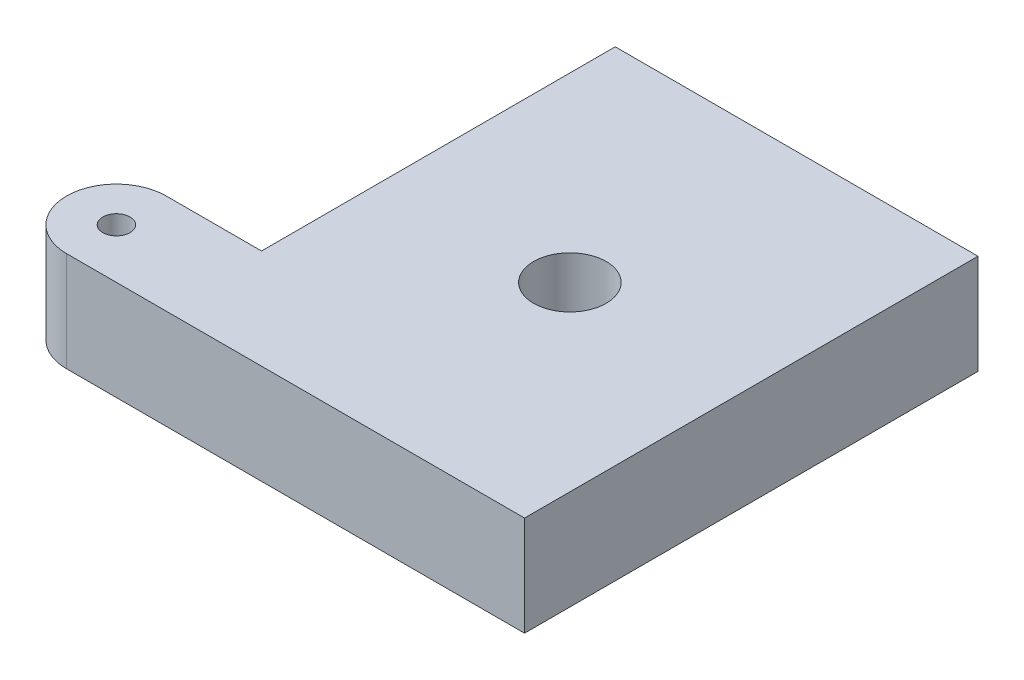
ISO-10303-21;
HEADER;
FILE_DESCRIPTION(('STEP AP214'),'2;1');
FILE_NAME('part.step','',(''),(''),'','','');
FILE_SCHEMA(('AUTOMOTIVE_DESIGN { 1 0 10303 214 1 1 1 1 }'));
ENDSEC;
DATA;
#1=APPLICATION_CONTEXT('core data for automotive mechanical design processes');
#2=APPLICATION_PROTOCOL_DEFINITION('international standard','automotive_design',2000,#1);
#3=PRODUCT_CONTEXT('',#1,'mechanical');
#4=PRODUCT('Part','Part','',(#3));
#5=PRODUCT_RELATED_PRODUCT_CATEGORY('part','',(#4));
#6=PRODUCT_DEFINITION_FORMATION('','',#4);
#7=PRODUCT_DEFINITION_CONTEXT('part definition',#1,'design');
#8=PRODUCT_DEFINITION('design','',#6,#7);
#9=PRODUCT_DEFINITION_SHAPE('','',#8);
#10=(LENGTH_UNIT() NAMED_UNIT(*) SI_UNIT(.MILLI.,.METRE.));
#11=(NAMED_UNIT(*) PLANE_ANGLE_UNIT() SI_UNIT($,.RADIAN.));
#12=(NAMED_UNIT(*) SI_UNIT($,.STERADIAN.) SOLID_ANGLE_UNIT());
#13=UNCERTAINTY_MEASURE_WITH_UNIT(LENGTH_MEASURE(1.E-05),#10,'distance_accuracy_value','');
#14=(GEOMETRIC_REPRESENTATION_CONTEXT(3) GLOBAL_UNCERTAINTY_ASSIGNED_CONTEXT((#13)) GLOBAL_UNIT_ASSIGNED_CONTEXT((#10,
#11,#12)) REPRESENTATION_CONTEXT('',''));
#15=CARTESIAN_POINT('',(0.,0.,0.));
#16=DIRECTION('',(0.,0.,1.));
#17=DIRECTION('',(1.,0.,0.));
#18=AXIS2_PLACEMENT_3D('',#15,#16,#17);
#19=CARTESIAN_POINT('',(0.,22.,0.));
#20=DIRECTION('',(0.,1.,0.));
#21=DIRECTION('',(0.,0.,1.));
#22=AXIS2_PLACEMENT_3D('',#19,#20,#21);
#23=PLANE('',#22);
#24=CARTESIAN_POINT('',(0.,22.,0.));
#25=DIRECTION('',(0.,1.,0.));
#26=DIRECTION('',(0.,0.,1.));
#27=AXIS2_PLACEMENT_3D('',#24,#25,#26);
#28=CIRCLE('',#27,8.);
#29=CARTESIAN_POINT('',(0.,22.,8.));
#30=VERTEX_POINT('',#29);
#31=EDGE_CURVE('E143',#30,#30,#28,.F.);
#32=ORIENTED_EDGE('',*,*,#31,.T.);
#33=EDGE_LOOP('',(#32));
#34=FACE_BOUND('',#33,.T.);
#35=CARTESIAN_POINT('',(-61.,22.,39.));
#36=DIRECTION('',(0.,-1.,0.));
#37=DIRECTION('',(0.,0.,-1.));
#38=AXIS2_PLACEMENT_3D('',#35,#36,#37);
#39=CIRCLE('',#38,3.);
#40=CARTESIAN_POINT('',(-61.,22.,36.));
#41=VERTEX_POINT('',#40);
#42=EDGE_CURVE('E145',#41,#41,#39,.T.);
#43=ORIENTED_EDGE('',*,*,#42,.T.);
#44=EDGE_LOOP('',(#43));
#45=FACE_BOUND('',#44,.T.);
#46=DIRECTION('',(-1.,0.,0.));
#47=VECTOR('',#46,1.);
#48=CARTESIAN_POINT('',(-40.,22.,28.));
#49=LINE('',#48,#47);
#50=CARTESIAN_POINT('',(-61.,22.,28.));
#51=VERTEX_POINT('',#50);
#52=CARTESIAN_POINT('',(-40.,22.,28.));
#53=VERTEX_POINT('',#52);
#54=EDGE_CURVE('E82',#51,#53,#49,.F.);
#55=ORIENTED_EDGE('',*,*,#54,.F.);
#56=CARTESIAN_POINT('',(-61.,22.,39.));
#57=DIRECTION('',(0.,1.,0.));
#58=DIRECTION('',(0.,0.,1.));
#59=AXIS2_PLACEMENT_3D('',#56,#57,#58);
#60=CIRCLE('',#59,11.);
#61=CARTESIAN_POINT('',(-61.,22.,50.));
#62=VERTEX_POINT('',#61);
#63=EDGE_CURVE('E20',#62,#51,#60,.F.);
#64=ORIENTED_EDGE('',*,*,#63,.F.);
#65=DIRECTION('',(1.,0.,0.));
#66=VECTOR('',#65,1.);
#67=CARTESIAN_POINT('',(-40.,22.,50.));
#68=LINE('',#67,#66);
#69=CARTESIAN_POINT('',(40.,22.,50.));
#70=VERTEX_POINT('',#69);
#71=EDGE_CURVE('E46',#70,#62,#68,.F.);
#72=ORIENTED_EDGE('',*,*,#71,.F.);
#73=DIRECTION('',(0.,0.,-1.));
#74=VECTOR('',#73,1.);
#75=CARTESIAN_POINT('',(40.,22.,50.));
#76=LINE('',#75,#74);
#77=CARTESIAN_POINT('',(40.,22.,-50.));
#78=VERTEX_POINT('',#77);
#79=EDGE_CURVE('E57',#78,#70,#76,.F.);
#80=ORIENTED_EDGE('',*,*,#79,.F.);
#81=DIRECTION('',(-1.,0.,0.));
#82=VECTOR('',#81,1.);
#83=CARTESIAN_POINT('',(40.,22.,-50.));
#84=LINE('',#83,#82);
#85=CARTESIAN_POINT('',(-40.,22.,-50.));
#86=VERTEX_POINT('',#85);
#87=EDGE_CURVE('E69',#86,#78,#84,.F.);
#88=ORIENTED_EDGE('',*,*,#87,.F.);
#89=DIRECTION('',(0.,0.,1.));
#90=VECTOR('',#89,1.);
#91=CARTESIAN_POINT('',(-40.,22.,-50.));
#92=LINE('',#91,#90);
#93=EDGE_CURVE('E75',#53,#86,#92,.F.);
#94=ORIENTED_EDGE('',*,*,#93,.F.);
#95=EDGE_LOOP('',(#55,#64,#72,#80,#88,#94));
#96=FACE_BOUND('',#95,.T.);
#97=ADVANCED_FACE('F17',(#34,#45,#96),#23,.T.);
#98=CARTESIAN_POINT('',(40.,0.,50.));
#99=DIRECTION('',(1.,0.,0.));
#100=DIRECTION('',(0.,0.,-1.));
#101=AXIS2_PLACEMENT_3D('',#98,#99,#100);
#102=PLANE('',#101);
#103=ORIENTED_EDGE('',*,*,#79,.T.);
#104=DIRECTION('',(0.,1.,0.));
#105=VECTOR('',#104,1.);
#106=CARTESIAN_POINT('',(40.,0.,50.));
#107=LINE('',#106,#105);
#108=CARTESIAN_POINT('',(40.,0.,50.));
#109=VERTEX_POINT('',#108);
#110=EDGE_CURVE('E124',#109,#70,#107,.T.);
#111=ORIENTED_EDGE('',*,*,#110,.F.);
#112=DIRECTION('',(0.,0.,1.));
#113=VECTOR('',#112,1.);
#114=CARTESIAN_POINT('',(40.,0.,0.));
#115=LINE('',#114,#113);
#116=CARTESIAN_POINT('',(40.,0.,-50.));
#117=VERTEX_POINT('',#116);
#118=EDGE_CURVE('E108',#109,#117,#115,.F.);
#119=ORIENTED_EDGE('',*,*,#118,.T.);
#120=DIRECTION('',(0.,1.,0.));
#121=VECTOR('',#120,1.);
#122=CARTESIAN_POINT('',(40.,0.,-50.));
#123=LINE('',#122,#121);
#124=EDGE_CURVE('E87',#78,#117,#123,.F.);
#125=ORIENTED_EDGE('',*,*,#124,.F.);
#126=EDGE_LOOP('',(#103,#111,#119,#125));
#127=FACE_BOUND('',#126,.T.);
#128=ADVANCED_FACE('F165',(#127),#102,.T.);
#129=CARTESIAN_POINT('',(40.,0.,-50.));
#130=DIRECTION('',(0.,0.,-1.));
#131=DIRECTION('',(-1.,0.,0.));
#132=AXIS2_PLACEMENT_3D('',#129,#130,#131);
#133=PLANE('',#132);
#134=ORIENTED_EDGE('',*,*,#87,.T.);
#135=ORIENTED_EDGE('',*,*,#124,.T.);
#136=DIRECTION('',(1.,0.,0.));
#137=VECTOR('',#136,1.);
#138=CARTESIAN_POINT('',(0.,0.,-50.));
#139=LINE('',#138,#137);
#140=CARTESIAN_POINT('',(-40.,0.,-50.));
#141=VERTEX_POINT('',#140);
#142=EDGE_CURVE('E106',#117,#141,#139,.F.);
#143=ORIENTED_EDGE('',*,*,#142,.T.);
#144=DIRECTION('',(0.,1.,0.));
#145=VECTOR('',#144,1.);
#146=CARTESIAN_POINT('',(-40.,0.,-50.));
#147=LINE('',#146,#145);
#148=EDGE_CURVE('E90',#86,#141,#147,.F.);
#149=ORIENTED_EDGE('',*,*,#148,.F.);
#150=EDGE_LOOP('',(#134,#135,#143,#149));
#151=FACE_BOUND('',#150,.T.);
#152=ADVANCED_FACE('F164',(#151),#133,.T.);
#153=CARTESIAN_POINT('',(-40.,0.,-50.));
#154=DIRECTION('',(-1.,0.,0.));
#155=DIRECTION('',(0.,0.,1.));
#156=AXIS2_PLACEMENT_3D('',#153,#154,#155);
#157=PLANE('',#156);
#158=ORIENTED_EDGE('',*,*,#148,.T.);
#159=DIRECTION('',(0.,0.,1.));
#160=VECTOR('',#159,1.);
#161=CARTESIAN_POINT('',(-40.,0.,0.));
#162=LINE('',#161,#160);
#163=CARTESIAN_POINT('',(-40.,0.,28.));
#164=VERTEX_POINT('',#163);
#165=EDGE_CURVE('E101',#141,#164,#162,.T.);
#166=ORIENTED_EDGE('',*,*,#165,.T.);
#167=DIRECTION('',(0.,1.,0.));
#168=VECTOR('',#167,1.);
#169=CARTESIAN_POINT('',(-40.,0.,28.));
#170=LINE('',#169,#168);
#171=EDGE_CURVE('E93',#53,#164,#170,.F.);
#172=ORIENTED_EDGE('',*,*,#171,.F.);
#173=ORIENTED_EDGE('',*,*,#93,.T.);
#174=EDGE_LOOP('',(#158,#166,#172,#173));
#175=FACE_BOUND('',#174,.T.);
#176=ADVANCED_FACE('F105',(#175),#157,.T.);
#177=CARTESIAN_POINT('',(-40.,0.,28.));
#178=DIRECTION('',(0.,0.,-1.));
#179=DIRECTION('',(-1.,0.,0.));
#180=AXIS2_PLACEMENT_3D('',#177,#178,#179);
#181=PLANE('',#180);
#182=DIRECTION('',(1.,0.,0.));
#183=VECTOR('',#182,1.);
#184=CARTESIAN_POINT('',(0.,0.,28.));
#185=LINE('',#184,#183);
#186=CARTESIAN_POINT('',(-61.,0.,28.));
#187=VERTEX_POINT('',#186);
#188=EDGE_CURVE('E96',#164,#187,#185,.F.);
#189=ORIENTED_EDGE('',*,*,#188,.T.);
#190=DIRECTION('',(0.,1.,0.));
#191=VECTOR('',#190,1.);
#192=CARTESIAN_POINT('',(-61.,0.,28.));
#193=LINE('',#192,#191);
#194=EDGE_CURVE('E154',#51,#187,#193,.F.);
#195=ORIENTED_EDGE('',*,*,#194,.F.);
#196=ORIENTED_EDGE('',*,*,#54,.T.);
#197=ORIENTED_EDGE('',*,*,#171,.T.);
#198=EDGE_LOOP('',(#189,#195,#196,#197));
#199=FACE_BOUND('',#198,.T.);
#200=ADVANCED_FACE('F95',(#199),#181,.T.);
#201=CARTESIAN_POINT('',(-61.,0.,39.));
#202=DIRECTION('',(0.,1.,0.));
#203=DIRECTION('',(0.,0.,1.));
#204=AXIS2_PLACEMENT_3D('',#201,#202,#203);
#205=CYLINDRICAL_SURFACE('',#204,11.);
#206=CARTESIAN_POINT('',(-61.,0.,39.));
#207=DIRECTION('',(0.,1.,0.));
#208=DIRECTION('',(0.,0.,1.));
#209=AXIS2_PLACEMENT_3D('',#206,#207,#208);
#210=CIRCLE('',#209,11.);
#211=CARTESIAN_POINT('',(-61.,0.,50.));
#212=VERTEX_POINT('',#211);
#213=EDGE_CURVE('E103',#187,#212,#210,.T.);
#214=ORIENTED_EDGE('',*,*,#213,.T.);
#215=DIRECTION('',(0.,1.,0.));
#216=VECTOR('',#215,1.);
#217=CARTESIAN_POINT('',(-61.,0.,50.));
#218=LINE('',#217,#216);
#219=EDGE_CURVE('E35',#62,#212,#218,.F.);
#220=ORIENTED_EDGE('',*,*,#219,.F.);
#221=ORIENTED_EDGE('',*,*,#63,.T.);
#222=ORIENTED_EDGE('',*,*,#194,.T.);
#223=EDGE_LOOP('',(#214,#220,#221,#222));
#224=FACE_BOUND('',#223,.T.);
#225=ADVANCED_FACE('F162',(#224),#205,.T.);
#226=CARTESIAN_POINT('',(-40.,0.,50.));
#227=DIRECTION('',(0.,0.,1.));
#228=DIRECTION('',(1.,0.,0.));
#229=AXIS2_PLACEMENT_3D('',#226,#227,#228);
#230=PLANE('',#229);
#231=ORIENTED_EDGE('',*,*,#71,.T.);
#232=ORIENTED_EDGE('',*,*,#219,.T.);
#233=DIRECTION('',(1.,0.,0.));
#234=VECTOR('',#233,1.);
#235=CARTESIAN_POINT('',(0.,0.,50.));
#236=LINE('',#235,#234);
#237=EDGE_CURVE('E141',#212,#109,#236,.T.);
#238=ORIENTED_EDGE('',*,*,#237,.T.);
#239=ORIENTED_EDGE('',*,*,#110,.T.);
#240=EDGE_LOOP('',(#231,#232,#238,#239));
#241=FACE_BOUND('',#240,.T.);
#242=ADVANCED_FACE('F166',(#241),#230,.T.);
#243=CARTESIAN_POINT('',(-61.,151.749794069053,39.));
#244=DIRECTION('',(0.,-1.,0.));
#245=DIRECTION('',(0.,0.,-1.));
#246=AXIS2_PLACEMENT_3D('',#243,#244,#245);
#247=CYLINDRICAL_SURFACE('',#246,3.);
#248=CARTESIAN_POINT('',(-61.,0.,39.));
#249=DIRECTION('',(0.,-1.,0.));
#250=DIRECTION('',(0.,0.,-1.));
#251=AXIS2_PLACEMENT_3D('',#248,#249,#250);
#252=CIRCLE('',#251,3.);
#253=CARTESIAN_POINT('',(-61.,0.,36.));
#254=VERTEX_POINT('',#253);
#255=EDGE_CURVE('E26',#254,#254,#252,.T.);
#256=ORIENTED_EDGE('',*,*,#255,.T.);
#257=EDGE_LOOP('',(#256));
#258=FACE_BOUND('',#257,.T.);
#259=ORIENTED_EDGE('',*,*,#42,.F.);
#260=EDGE_LOOP('',(#259));
#261=FACE_BOUND('',#260,.T.);
#262=ADVANCED_FACE('F171',(#258,#261),#247,.F.);
#263=CARTESIAN_POINT('',(0.,0.,0.));
#264=DIRECTION('',(0.,1.,0.));
#265=DIRECTION('',(0.,0.,1.));
#266=AXIS2_PLACEMENT_3D('',#263,#264,#265);
#267=CYLINDRICAL_SURFACE('',#266,8.);
#268=CARTESIAN_POINT('',(0.,0.,0.));
#269=DIRECTION('',(0.,1.,0.));
#270=DIRECTION('',(0.,0.,1.));
#271=AXIS2_PLACEMENT_3D('',#268,#269,#270);
#272=CIRCLE('',#271,8.);
#273=CARTESIAN_POINT('',(0.,0.,8.));
#274=VERTEX_POINT('',#273);
#275=EDGE_CURVE('E11',#274,#274,#272,.F.);
#276=ORIENTED_EDGE('',*,*,#275,.T.);
#277=EDGE_LOOP('',(#276));
#278=FACE_BOUND('',#277,.T.);
#279=ORIENTED_EDGE('',*,*,#31,.F.);
#280=EDGE_LOOP('',(#279));
#281=FACE_BOUND('',#280,.T.);
#282=ADVANCED_FACE('F178',(#278,#281),#267,.F.);
#283=CARTESIAN_POINT('',(0.,0.,0.));
#284=DIRECTION('',(0.,1.,0.));
#285=DIRECTION('',(0.,0.,1.));
#286=AXIS2_PLACEMENT_3D('',#283,#284,#285);
#287=PLANE('',#286);
#288=ORIENTED_EDGE('',*,*,#275,.F.);
#289=EDGE_LOOP('',(#288));
#290=FACE_BOUND('',#289,.T.);
#291=ORIENTED_EDGE('',*,*,#255,.F.);
#292=EDGE_LOOP('',(#291));
#293=FACE_BOUND('',#292,.T.);
#294=ORIENTED_EDGE('',*,*,#213,.F.);
#295=ORIENTED_EDGE('',*,*,#188,.F.);
#296=ORIENTED_EDGE('',*,*,#165,.F.);
#297=ORIENTED_EDGE('',*,*,#142,.F.);
#298=ORIENTED_EDGE('',*,*,#118,.F.);
#299=ORIENTED_EDGE('',*,*,#237,.F.);
#300=EDGE_LOOP('',(#294,#295,#296,#297,#298,#299));
#301=FACE_BOUND('',#300,.T.);
#302=ADVANCED_FACE('F100',(#290,#293,#301),#287,.F.);
#303=CLOSED_SHELL('',(#97,#128,#152,#176,#200,#225,#242,#262,#282,#302));
#304=MANIFOLD_SOLID_BREP('B1',#303);
#305=ADVANCED_BREP_SHAPE_REPRESENTATION('',(#18,#304),#14);
#306=SHAPE_DEFINITION_REPRESENTATION(#9,#305);
ENDSEC;
END-ISO-10303-21;
